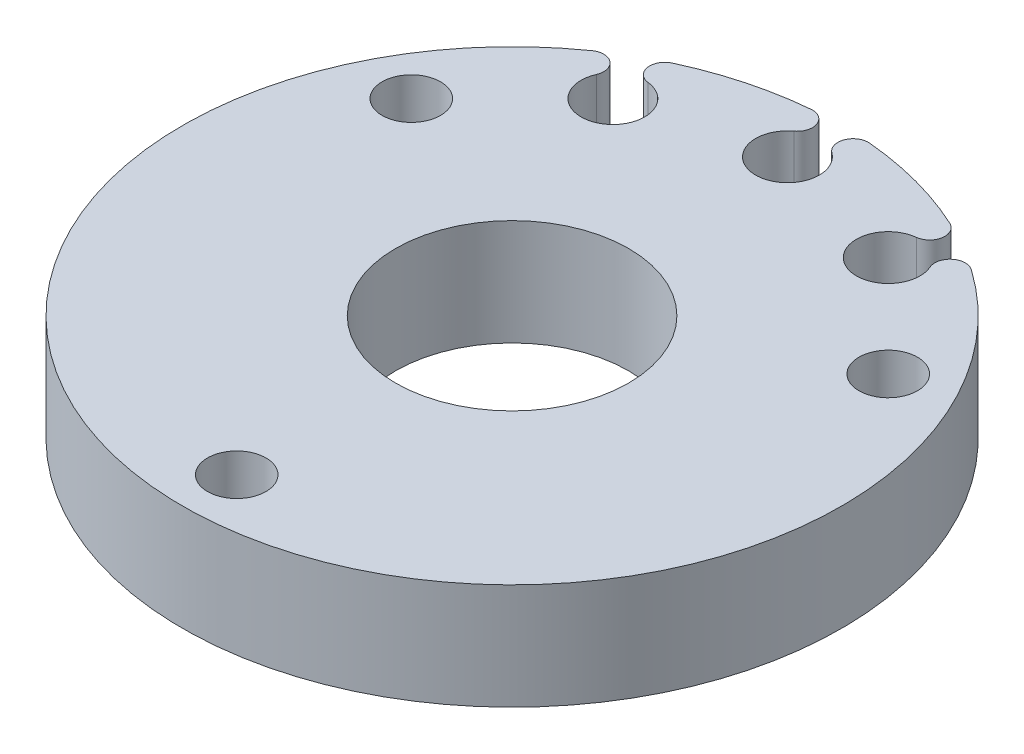
ISO-10303-21;
HEADER;
FILE_DESCRIPTION(('STEP AP214'),'2;1');
FILE_NAME('part.step','',(''),(''),'','','');
FILE_SCHEMA(('AUTOMOTIVE_DESIGN { 1 0 10303 214 1 1 1 1 }'));
ENDSEC;
DATA;
#1=APPLICATION_CONTEXT('core data for automotive mechanical design processes');
#2=APPLICATION_PROTOCOL_DEFINITION('international standard','automotive_design',2000,#1);
#3=PRODUCT_CONTEXT('',#1,'mechanical');
#4=PRODUCT('Part','Part','',(#3));
#5=PRODUCT_RELATED_PRODUCT_CATEGORY('part','',(#4));
#6=PRODUCT_DEFINITION_FORMATION('','',#4);
#7=PRODUCT_DEFINITION_CONTEXT('part definition',#1,'design');
#8=PRODUCT_DEFINITION('design','',#6,#7);
#9=PRODUCT_DEFINITION_SHAPE('','',#8);
#10=(LENGTH_UNIT() NAMED_UNIT(*) SI_UNIT(.MILLI.,.METRE.));
#11=(NAMED_UNIT(*) PLANE_ANGLE_UNIT() SI_UNIT($,.RADIAN.));
#12=(NAMED_UNIT(*) SI_UNIT($,.STERADIAN.) SOLID_ANGLE_UNIT());
#13=UNCERTAINTY_MEASURE_WITH_UNIT(LENGTH_MEASURE(1.E-05),#10,'distance_accuracy_value','');
#14=(GEOMETRIC_REPRESENTATION_CONTEXT(3) GLOBAL_UNCERTAINTY_ASSIGNED_CONTEXT((#13)) GLOBAL_UNIT_ASSIGNED_CONTEXT((#10,
#11,#12)) REPRESENTATION_CONTEXT('',''));
#15=CARTESIAN_POINT('',(0.,0.,0.));
#16=DIRECTION('',(0.,0.,1.));
#17=DIRECTION('',(1.,0.,0.));
#18=AXIS2_PLACEMENT_3D('',#15,#16,#17);
#19=CARTESIAN_POINT('',(0.,6.35,0.));
#20=DIRECTION('',(0.,-1.,0.));
#21=DIRECTION('',(0.,0.,-1.));
#22=AXIS2_PLACEMENT_3D('',#19,#20,#21);
#23=CYLINDRICAL_SURFACE('',#22,19.75);
#24=DIRECTION('',(0.,1.,0.));
#25=VECTOR('',#24,1.);
#26=CARTESIAN_POINT('',(-11.3545625208397,0.,-16.1597156522119));
#27=LINE('',#26,#25);
#28=CARTESIAN_POINT('',(-11.3545625208397,0.,-16.1597156522119));
#29=VERTEX_POINT('',#28);
#30=CARTESIAN_POINT('',(-11.3545625208397,6.35,-16.1597156522119));
#31=VERTEX_POINT('',#30);
#32=EDGE_CURVE('E138',#29,#31,#27,.T.);
#33=ORIENTED_EDGE('',*,*,#32,.F.);
#34=CARTESIAN_POINT('',(0.,0.,0.));
#35=DIRECTION('',(0.,1.,0.));
#36=DIRECTION('',(0.,0.,1.));
#37=AXIS2_PLACEMENT_3D('',#34,#35,#36);
#38=CIRCLE('',#37,19.75);
#39=CARTESIAN_POINT('',(11.3545625208397,0.,-16.1597156522119));
#40=VERTEX_POINT('',#39);
#41=EDGE_CURVE('E151',#29,#40,#38,.T.);
#42=ORIENTED_EDGE('',*,*,#41,.T.);
#43=DIRECTION('',(0.,1.,0.));
#44=VECTOR('',#43,1.);
#45=CARTESIAN_POINT('',(11.3545625208397,0.,-16.1597156522119));
#46=LINE('',#45,#44);
#47=CARTESIAN_POINT('',(11.3545625208397,6.35,-16.1597156522119));
#48=VERTEX_POINT('',#47);
#49=EDGE_CURVE('E186',#40,#48,#46,.T.);
#50=ORIENTED_EDGE('',*,*,#49,.T.);
#51=CARTESIAN_POINT('',(0.,6.35,0.));
#52=DIRECTION('',(0.,1.,0.));
#53=DIRECTION('',(0.,0.,1.));
#54=AXIS2_PLACEMENT_3D('',#51,#52,#53);
#55=CIRCLE('',#54,19.75);
#56=EDGE_CURVE('E47',#31,#48,#55,.T.);
#57=ORIENTED_EDGE('',*,*,#56,.F.);
#58=EDGE_LOOP('',(#33,#42,#50,#57));
#59=FACE_BOUND('',#58,.T.);
#60=ADVANCED_FACE('F37',(#59),#23,.T.);
#61=CARTESIAN_POINT('',(-1.7534817657999,0.,-19.6720055331684));
#62=VERTEX_POINT('',#61);
#63=CARTESIAN_POINT('',(-8.31744301232874,0.,-17.9131974180118));
#64=VERTEX_POINT('',#63);
#65=EDGE_CURVE('E144',#62,#64,#38,.T.);
#66=ORIENTED_EDGE('',*,*,#65,.T.);
#67=DIRECTION('',(0.,1.,0.));
#68=VECTOR('',#67,1.);
#69=CARTESIAN_POINT('',(-8.31744301232874,0.,-17.9131974180118));
#70=LINE('',#69,#68);
#71=CARTESIAN_POINT('',(-8.31744301232874,6.35,-17.9131974180118));
#72=VERTEX_POINT('',#71);
#73=EDGE_CURVE('E128',#64,#72,#70,.T.);
#74=ORIENTED_EDGE('',*,*,#73,.T.);
#75=CARTESIAN_POINT('',(-1.7534817657999,6.35,-19.6720055331684));
#76=VERTEX_POINT('',#75);
#77=EDGE_CURVE('E46',#76,#72,#55,.T.);
#78=ORIENTED_EDGE('',*,*,#77,.F.);
#79=DIRECTION('',(0.,1.,0.));
#80=VECTOR('',#79,1.);
#81=CARTESIAN_POINT('',(-1.7534817657999,0.,-19.6720055331684));
#82=LINE('',#81,#80);
#83=EDGE_CURVE('E150',#62,#76,#82,.T.);
#84=ORIENTED_EDGE('',*,*,#83,.F.);
#85=EDGE_LOOP('',(#66,#74,#78,#84));
#86=FACE_BOUND('',#85,.T.);
#87=ADVANCED_FACE('F149',(#86),#23,.T.);
#88=CARTESIAN_POINT('',(0.,6.35,0.));
#89=DIRECTION('',(0.,1.,0.));
#90=DIRECTION('',(0.,0.,1.));
#91=AXIS2_PLACEMENT_3D('',#88,#89,#90);
#92=PLANE('',#91);
#93=CARTESIAN_POINT('',(-7.93394264831237,6.35,-17.0872563541149));
#94=DIRECTION('',(0.,-1.,0.));
#95=DIRECTION('',(0.86602540378444,0.,0.499999999999998));
#96=AXIS2_PLACEMENT_3D('',#93,#94,#95);
#97=CIRCLE('',#96,0.910632291450185);
#98=CARTESIAN_POINT('',(-8.03616197264353,6.35,-16.1823793569683));
#99=VERTEX_POINT('',#98);
#100=EDGE_CURVE('E133',#99,#72,#97,.T.);
#101=ORIENTED_EDGE('',*,*,#100,.F.);
#102=CARTESIAN_POINT('',(-8.25000000000003,6.35,-14.2894191624432));
#103=DIRECTION('',(0.,1.,0.));
#104=DIRECTION('',(0.86602540378444,0.,0.499999999999998));
#105=AXIS2_PLACEMENT_3D('',#102,#103,#104);
#106=CIRCLE('',#105,1.905);
#107=CARTESIAN_POINT('',(-9.99627063048971,6.35,-15.0507100957198));
#108=VERTEX_POINT('',#107);
#109=EDGE_CURVE('E147',#108,#99,#106,.T.);
#110=ORIENTED_EDGE('',*,*,#109,.F.);
#111=CARTESIAN_POINT('',(-10.8310267594844,6.35,-15.4146240626647));
#112=DIRECTION('',(0.,-1.,0.));
#113=DIRECTION('',(-0.86602540378444,0.,-0.499999999999998));
#114=AXIS2_PLACEMENT_3D('',#111,#112,#113);
#115=CIRCLE('',#114,0.910632291450183);
#116=EDGE_CURVE('E241',#31,#108,#115,.T.);
#117=ORIENTED_EDGE('',*,*,#116,.F.);
#118=ORIENTED_EDGE('',*,*,#56,.T.);
#119=CARTESIAN_POINT('',(10.8310267594844,6.35,-15.4146240626647));
#120=DIRECTION('',(0.,-1.,0.));
#121=DIRECTION('',(0.,0.,1.));
#122=AXIS2_PLACEMENT_3D('',#119,#120,#121);
#123=CIRCLE('',#122,0.910632291450185);
#124=CARTESIAN_POINT('',(9.99627063048967,6.35,-15.0507100957199));
#125=VERTEX_POINT('',#124);
#126=EDGE_CURVE('E201',#125,#48,#123,.T.);
#127=ORIENTED_EDGE('',*,*,#126,.F.);
#128=CARTESIAN_POINT('',(8.25,6.35,-14.2894191624432));
#129=DIRECTION('',(0.,1.,0.));
#130=DIRECTION('',(0.,0.,1.));
#131=AXIS2_PLACEMENT_3D('',#128,#129,#130);
#132=CIRCLE('',#131,1.905);
#133=CARTESIAN_POINT('',(8.03616197264349,6.35,-16.1823793569683));
#134=VERTEX_POINT('',#133);
#135=EDGE_CURVE('E194',#134,#125,#132,.T.);
#136=ORIENTED_EDGE('',*,*,#135,.F.);
#137=CARTESIAN_POINT('',(7.93394264831234,6.35,-17.0872563541149));
#138=DIRECTION('',(0.,-1.,0.));
#139=DIRECTION('',(0.,0.,-1.));
#140=AXIS2_PLACEMENT_3D('',#137,#138,#139);
#141=CIRCLE('',#140,0.910632291450183);
#142=CARTESIAN_POINT('',(8.3174430123287,6.35,-17.9131974180118));
#143=VERTEX_POINT('',#142);
#144=EDGE_CURVE('E198',#143,#134,#141,.T.);
#145=ORIENTED_EDGE('',*,*,#144,.F.);
#146=CARTESIAN_POINT('',(1.75348176579986,6.35,-19.6720055331684));
#147=VERTEX_POINT('',#146);
#148=EDGE_CURVE('E11',#143,#147,#55,.T.);
#149=ORIENTED_EDGE('',*,*,#148,.T.);
#150=CARTESIAN_POINT('',(1.67263229145016,6.35,-18.7649694077967));
#151=DIRECTION('',(0.,-1.,0.));
#152=DIRECTION('',(0.500000000000001,0.,0.866025403784438));
#153=AXIS2_PLACEMENT_3D('',#150,#151,#152);
#154=CIRCLE('',#153,0.910632291450185);
#155=CARTESIAN_POINT('',(1.13166926124839,6.35,-18.0324326031332));
#156=VERTEX_POINT('',#155);
#157=EDGE_CURVE('E227',#156,#147,#154,.T.);
#158=ORIENTED_EDGE('',*,*,#157,.F.);
#159=CARTESIAN_POINT('',(0.,6.35,-16.5));
#160=DIRECTION('',(0.,1.,0.));
#161=DIRECTION('',(0.500000000000001,0.,0.866025403784438));
#162=AXIS2_PLACEMENT_3D('',#159,#160,#161);
#163=CIRCLE('',#162,1.905);
#164=CARTESIAN_POINT('',(-1.13166926124843,6.35,-18.0324326031332));
#165=VERTEX_POINT('',#164);
#166=EDGE_CURVE('E220',#165,#156,#163,.T.);
#167=ORIENTED_EDGE('',*,*,#166,.F.);
#168=CARTESIAN_POINT('',(-1.6726322914502,6.35,-18.7649694077967));
#169=DIRECTION('',(0.,-1.,0.));
#170=DIRECTION('',(-0.500000000000001,0.,-0.866025403784438));
#171=AXIS2_PLACEMENT_3D('',#168,#169,#170);
#172=CIRCLE('',#171,0.910632291450183);
#173=EDGE_CURVE('E224',#76,#165,#172,.T.);
#174=ORIENTED_EDGE('',*,*,#173,.F.);
#175=ORIENTED_EDGE('',*,*,#77,.T.);
#176=EDGE_LOOP('',(#101,#110,#117,#118,#127,#136,#145,#149,#158,#167,#174,#175));
#177=FACE_BOUND('',#176,.T.);
#178=CARTESIAN_POINT('',(0.,6.35,16.5));
#179=DIRECTION('',(0.,1.,0.));
#180=DIRECTION('',(0.,0.,1.));
#181=AXIS2_PLACEMENT_3D('',#178,#179,#180);
#182=CIRCLE('',#181,1.75);
#183=CARTESIAN_POINT('',(0.,6.35,18.25));
#184=VERTEX_POINT('',#183);
#185=EDGE_CURVE('E171',#184,#184,#182,.T.);
#186=ORIENTED_EDGE('',*,*,#185,.F.);
#187=EDGE_LOOP('',(#186));
#188=FACE_BOUND('',#187,.T.);
#189=CARTESIAN_POINT('',(0.,6.35,0.));
#190=DIRECTION('',(0.,1.,0.));
#191=DIRECTION('',(0.,0.,1.));
#192=AXIS2_PLACEMENT_3D('',#189,#190,#191);
#193=CIRCLE('',#192,6.985);
#194=CARTESIAN_POINT('',(0.,6.35,6.985));
#195=VERTEX_POINT('',#194);
#196=EDGE_CURVE('E153',#195,#195,#193,.T.);
#197=ORIENTED_EDGE('',*,*,#196,.F.);
#198=EDGE_LOOP('',(#197));
#199=FACE_BOUND('',#198,.T.);
#200=CARTESIAN_POINT('',(-14.2894191624432,6.35,-8.25));
#201=DIRECTION('',(0.,1.,0.));
#202=DIRECTION('',(0.,0.,1.));
#203=AXIS2_PLACEMENT_3D('',#200,#201,#202);
#204=CIRCLE('',#203,1.75);
#205=CARTESIAN_POINT('',(-14.2894191624432,6.35,-6.5));
#206=VERTEX_POINT('',#205);
#207=EDGE_CURVE('E165',#206,#206,#204,.T.);
#208=ORIENTED_EDGE('',*,*,#207,.F.);
#209=EDGE_LOOP('',(#208));
#210=FACE_BOUND('',#209,.T.);
#211=CARTESIAN_POINT('',(14.2894191624432,6.35,-8.25));
#212=DIRECTION('',(0.,1.,0.));
#213=DIRECTION('',(0.,0.,1.));
#214=AXIS2_PLACEMENT_3D('',#211,#212,#213);
#215=CIRCLE('',#214,1.75);
#216=CARTESIAN_POINT('',(14.2894191624432,6.35,-6.5));
#217=VERTEX_POINT('',#216);
#218=EDGE_CURVE('E177',#217,#217,#215,.T.);
#219=ORIENTED_EDGE('',*,*,#218,.F.);
#220=EDGE_LOOP('',(#219));
#221=FACE_BOUND('',#220,.T.);
#222=ADVANCED_FACE('F253',(#177,#188,#199,#210,#221),#92,.T.);
#223=CARTESIAN_POINT('',(0.,0.,0.));
#224=DIRECTION('',(0.,1.,0.));
#225=DIRECTION('',(0.,0.,1.));
#226=AXIS2_PLACEMENT_3D('',#223,#224,#225);
#227=PLANE('',#226);
#228=CARTESIAN_POINT('',(0.,0.,16.5));
#229=DIRECTION('',(0.,1.,0.));
#230=DIRECTION('',(0.,0.,1.));
#231=AXIS2_PLACEMENT_3D('',#228,#229,#230);
#232=CIRCLE('',#231,1.75);
#233=CARTESIAN_POINT('',(0.,0.,18.25));
#234=VERTEX_POINT('',#233);
#235=EDGE_CURVE('E174',#234,#234,#232,.T.);
#236=ORIENTED_EDGE('',*,*,#235,.T.);
#237=EDGE_LOOP('',(#236));
#238=FACE_BOUND('',#237,.T.);
#239=CARTESIAN_POINT('',(0.,0.,0.));
#240=DIRECTION('',(0.,1.,0.));
#241=DIRECTION('',(0.,0.,1.));
#242=AXIS2_PLACEMENT_3D('',#239,#240,#241);
#243=CIRCLE('',#242,6.985);
#244=CARTESIAN_POINT('',(0.,0.,6.985));
#245=VERTEX_POINT('',#244);
#246=EDGE_CURVE('E160',#245,#245,#243,.T.);
#247=ORIENTED_EDGE('',*,*,#246,.T.);
#248=EDGE_LOOP('',(#247));
#249=FACE_BOUND('',#248,.T.);
#250=CARTESIAN_POINT('',(-8.25000000000003,0.,-14.2894191624432));
#251=DIRECTION('',(0.,1.,0.));
#252=DIRECTION('',(0.86602540378444,0.,0.499999999999998));
#253=AXIS2_PLACEMENT_3D('',#250,#251,#252);
#254=CIRCLE('',#253,1.905);
#255=CARTESIAN_POINT('',(-9.99627063048971,0.,-15.0507100957198));
#256=VERTEX_POINT('',#255);
#257=CARTESIAN_POINT('',(-8.03616197264353,0.,-16.1823793569683));
#258=VERTEX_POINT('',#257);
#259=EDGE_CURVE('E54',#256,#258,#254,.T.);
#260=ORIENTED_EDGE('',*,*,#259,.T.);
#261=CARTESIAN_POINT('',(-7.93394264831237,0.,-17.0872563541149));
#262=DIRECTION('',(0.,-1.,0.));
#263=DIRECTION('',(0.86602540378444,0.,0.499999999999998));
#264=AXIS2_PLACEMENT_3D('',#261,#262,#263);
#265=CIRCLE('',#264,0.910632291450185);
#266=EDGE_CURVE('E131',#258,#64,#265,.T.);
#267=ORIENTED_EDGE('',*,*,#266,.T.);
#268=ORIENTED_EDGE('',*,*,#65,.F.);
#269=CARTESIAN_POINT('',(-1.6726322914502,0.,-18.7649694077967));
#270=DIRECTION('',(0.,-1.,0.));
#271=DIRECTION('',(-0.500000000000001,0.,-0.866025403784438));
#272=AXIS2_PLACEMENT_3D('',#269,#270,#271);
#273=CIRCLE('',#272,0.910632291450183);
#274=CARTESIAN_POINT('',(-1.13166926124843,0.,-18.0324326031332));
#275=VERTEX_POINT('',#274);
#276=EDGE_CURVE('E62',#62,#275,#273,.T.);
#277=ORIENTED_EDGE('',*,*,#276,.T.);
#278=CARTESIAN_POINT('',(0.,0.,-16.5));
#279=DIRECTION('',(0.,1.,0.));
#280=DIRECTION('',(0.500000000000001,0.,0.866025403784438));
#281=AXIS2_PLACEMENT_3D('',#278,#279,#280);
#282=CIRCLE('',#281,1.905);
#283=CARTESIAN_POINT('',(1.13166926124839,0.,-18.0324326031332));
#284=VERTEX_POINT('',#283);
#285=EDGE_CURVE('E215',#275,#284,#282,.T.);
#286=ORIENTED_EDGE('',*,*,#285,.T.);
#287=CARTESIAN_POINT('',(1.67263229145016,0.,-18.7649694077967));
#288=DIRECTION('',(0.,-1.,0.));
#289=DIRECTION('',(0.500000000000001,0.,0.866025403784438));
#290=AXIS2_PLACEMENT_3D('',#287,#288,#289);
#291=CIRCLE('',#290,0.910632291450185);
#292=CARTESIAN_POINT('',(1.75348176579986,0.,-19.6720055331684));
#293=VERTEX_POINT('',#292);
#294=EDGE_CURVE('E223',#284,#293,#291,.T.);
#295=ORIENTED_EDGE('',*,*,#294,.T.);
#296=CARTESIAN_POINT('',(8.3174430123287,0.,-17.9131974180118));
#297=VERTEX_POINT('',#296);
#298=EDGE_CURVE('E41',#297,#293,#38,.T.);
#299=ORIENTED_EDGE('',*,*,#298,.F.);
#300=CARTESIAN_POINT('',(7.93394264831234,0.,-17.0872563541149));
#301=DIRECTION('',(0.,-1.,0.));
#302=DIRECTION('',(0.,0.,-1.));
#303=AXIS2_PLACEMENT_3D('',#300,#301,#302);
#304=CIRCLE('',#303,0.910632291450183);
#305=CARTESIAN_POINT('',(8.03616197264349,0.,-16.1823793569683));
#306=VERTEX_POINT('',#305);
#307=EDGE_CURVE('E207',#297,#306,#304,.T.);
#308=ORIENTED_EDGE('',*,*,#307,.T.);
#309=CARTESIAN_POINT('',(8.25,0.,-14.2894191624432));
#310=DIRECTION('',(0.,1.,0.));
#311=DIRECTION('',(0.,0.,1.));
#312=AXIS2_PLACEMENT_3D('',#309,#310,#311);
#313=CIRCLE('',#312,1.905);
#314=CARTESIAN_POINT('',(9.99627063048967,0.,-15.0507100957199));
#315=VERTEX_POINT('',#314);
#316=EDGE_CURVE('E189',#306,#315,#313,.T.);
#317=ORIENTED_EDGE('',*,*,#316,.T.);
#318=CARTESIAN_POINT('',(10.8310267594844,0.,-15.4146240626647));
#319=DIRECTION('',(0.,-1.,0.));
#320=DIRECTION('',(0.,0.,1.));
#321=AXIS2_PLACEMENT_3D('',#318,#319,#320);
#322=CIRCLE('',#321,0.910632291450185);
#323=EDGE_CURVE('E197',#315,#40,#322,.T.);
#324=ORIENTED_EDGE('',*,*,#323,.T.);
#325=ORIENTED_EDGE('',*,*,#41,.F.);
#326=CARTESIAN_POINT('',(-10.8310267594844,0.,-15.4146240626647));
#327=DIRECTION('',(0.,-1.,0.));
#328=DIRECTION('',(-0.86602540378444,0.,-0.499999999999998));
#329=AXIS2_PLACEMENT_3D('',#326,#327,#328);
#330=CIRCLE('',#329,0.910632291450183);
#331=EDGE_CURVE('E146',#29,#256,#330,.T.);
#332=ORIENTED_EDGE('',*,*,#331,.T.);
#333=EDGE_LOOP('',(#260,#267,#268,#277,#286,#295,#299,#308,#317,#324,#325,#332));
#334=FACE_BOUND('',#333,.T.);
#335=CARTESIAN_POINT('',(-14.2894191624432,0.,-8.25));
#336=DIRECTION('',(0.,1.,0.));
#337=DIRECTION('',(0.,0.,1.));
#338=AXIS2_PLACEMENT_3D('',#335,#336,#337);
#339=CIRCLE('',#338,1.75);
#340=CARTESIAN_POINT('',(-14.2894191624432,0.,-6.5));
#341=VERTEX_POINT('',#340);
#342=EDGE_CURVE('E168',#341,#341,#339,.T.);
#343=ORIENTED_EDGE('',*,*,#342,.T.);
#344=EDGE_LOOP('',(#343));
#345=FACE_BOUND('',#344,.T.);
#346=CARTESIAN_POINT('',(14.2894191624432,0.,-8.25));
#347=DIRECTION('',(0.,1.,0.));
#348=DIRECTION('',(0.,0.,1.));
#349=AXIS2_PLACEMENT_3D('',#346,#347,#348);
#350=CIRCLE('',#349,1.75);
#351=CARTESIAN_POINT('',(14.2894191624432,0.,-6.5));
#352=VERTEX_POINT('',#351);
#353=EDGE_CURVE('E180',#352,#352,#350,.T.);
#354=ORIENTED_EDGE('',*,*,#353,.T.);
#355=EDGE_LOOP('',(#354));
#356=FACE_BOUND('',#355,.T.);
#357=ADVANCED_FACE('F142',(#238,#249,#334,#345,#356),#227,.F.);
#358=ORIENTED_EDGE('',*,*,#298,.T.);
#359=DIRECTION('',(0.,1.,0.));
#360=VECTOR('',#359,1.);
#361=CARTESIAN_POINT('',(1.75348176579986,0.,-19.6720055331684));
#362=LINE('',#361,#360);
#363=EDGE_CURVE('E212',#293,#147,#362,.T.);
#364=ORIENTED_EDGE('',*,*,#363,.T.);
#365=ORIENTED_EDGE('',*,*,#148,.F.);
#366=DIRECTION('',(0.,1.,0.));
#367=VECTOR('',#366,1.);
#368=CARTESIAN_POINT('',(8.3174430123287,0.,-17.9131974180118));
#369=LINE('',#368,#367);
#370=EDGE_CURVE('E188',#297,#143,#369,.T.);
#371=ORIENTED_EDGE('',*,*,#370,.F.);
#372=EDGE_LOOP('',(#358,#364,#365,#371));
#373=FACE_BOUND('',#372,.T.);
#374=ADVANCED_FACE('F39',(#373),#23,.T.);
#375=CARTESIAN_POINT('',(0.,6.35,0.));
#376=DIRECTION('',(0.,-1.,0.));
#377=DIRECTION('',(0.,0.,-1.));
#378=AXIS2_PLACEMENT_3D('',#375,#376,#377);
#379=CYLINDRICAL_SURFACE('',#378,6.985);
#380=ORIENTED_EDGE('',*,*,#196,.T.);
#381=EDGE_LOOP('',(#380));
#382=FACE_BOUND('',#381,.T.);
#383=ORIENTED_EDGE('',*,*,#246,.F.);
#384=EDGE_LOOP('',(#383));
#385=FACE_BOUND('',#384,.T.);
#386=ADVANCED_FACE('F295',(#382,#385),#379,.F.);
#387=CARTESIAN_POINT('',(-14.2894191624432,6.35,-8.25));
#388=DIRECTION('',(0.,-1.,0.));
#389=DIRECTION('',(0.,0.,-1.));
#390=AXIS2_PLACEMENT_3D('',#387,#388,#389);
#391=CYLINDRICAL_SURFACE('',#390,1.75);
#392=ORIENTED_EDGE('',*,*,#207,.T.);
#393=EDGE_LOOP('',(#392));
#394=FACE_BOUND('',#393,.T.);
#395=ORIENTED_EDGE('',*,*,#342,.F.);
#396=EDGE_LOOP('',(#395));
#397=FACE_BOUND('',#396,.T.);
#398=ADVANCED_FACE('F300',(#394,#397),#391,.F.);
#399=CARTESIAN_POINT('',(0.,6.35,16.5));
#400=DIRECTION('',(0.,-1.,0.));
#401=DIRECTION('',(0.,0.,-1.));
#402=AXIS2_PLACEMENT_3D('',#399,#400,#401);
#403=CYLINDRICAL_SURFACE('',#402,1.75);
#404=ORIENTED_EDGE('',*,*,#185,.T.);
#405=EDGE_LOOP('',(#404));
#406=FACE_BOUND('',#405,.T.);
#407=ORIENTED_EDGE('',*,*,#235,.F.);
#408=EDGE_LOOP('',(#407));
#409=FACE_BOUND('',#408,.T.);
#410=ADVANCED_FACE('F286',(#406,#409),#403,.F.);
#411=CARTESIAN_POINT('',(14.2894191624432,6.35,-8.25));
#412=DIRECTION('',(0.,-1.,0.));
#413=DIRECTION('',(0.,0.,-1.));
#414=AXIS2_PLACEMENT_3D('',#411,#412,#413);
#415=CYLINDRICAL_SURFACE('',#414,1.75);
#416=ORIENTED_EDGE('',*,*,#218,.T.);
#417=EDGE_LOOP('',(#416));
#418=FACE_BOUND('',#417,.T.);
#419=ORIENTED_EDGE('',*,*,#353,.F.);
#420=EDGE_LOOP('',(#419));
#421=FACE_BOUND('',#420,.T.);
#422=ADVANCED_FACE('F279',(#418,#421),#415,.F.);
#423=CARTESIAN_POINT('',(10.8310267594844,0.,-15.4146240626647));
#424=DIRECTION('',(0.,1.,0.));
#425=DIRECTION('',(0.,0.,1.));
#426=AXIS2_PLACEMENT_3D('',#423,#424,#425);
#427=CYLINDRICAL_SURFACE('',#426,0.910632291450185);
#428=ORIENTED_EDGE('',*,*,#126,.T.);
#429=ORIENTED_EDGE('',*,*,#49,.F.);
#430=ORIENTED_EDGE('',*,*,#323,.F.);
#431=DIRECTION('',(0.,1.,0.));
#432=VECTOR('',#431,1.);
#433=CARTESIAN_POINT('',(9.99627063048967,0.,-15.0507100957199));
#434=LINE('',#433,#432);
#435=EDGE_CURVE('E183',#315,#125,#434,.T.);
#436=ORIENTED_EDGE('',*,*,#435,.T.);
#437=EDGE_LOOP('',(#428,#429,#430,#436));
#438=FACE_BOUND('',#437,.T.);
#439=ADVANCED_FACE('F277',(#438),#427,.T.);
#440=CARTESIAN_POINT('',(8.25,0.,-14.2894191624432));
#441=DIRECTION('',(0.,1.,0.));
#442=DIRECTION('',(0.,0.,1.));
#443=AXIS2_PLACEMENT_3D('',#440,#441,#442);
#444=CYLINDRICAL_SURFACE('',#443,1.905);
#445=ORIENTED_EDGE('',*,*,#135,.T.);
#446=ORIENTED_EDGE('',*,*,#435,.F.);
#447=ORIENTED_EDGE('',*,*,#316,.F.);
#448=DIRECTION('',(0.,1.,0.));
#449=VECTOR('',#448,1.);
#450=CARTESIAN_POINT('',(8.03616197264349,0.,-16.1823793569683));
#451=LINE('',#450,#449);
#452=EDGE_CURVE('E191',#306,#134,#451,.T.);
#453=ORIENTED_EDGE('',*,*,#452,.T.);
#454=EDGE_LOOP('',(#445,#446,#447,#453));
#455=FACE_BOUND('',#454,.T.);
#456=ADVANCED_FACE('F273',(#455),#444,.F.);
#457=CARTESIAN_POINT('',(7.93394264831234,0.,-17.0872563541149));
#458=DIRECTION('',(0.,1.,0.));
#459=DIRECTION('',(0.,0.,1.));
#460=AXIS2_PLACEMENT_3D('',#457,#458,#459);
#461=CYLINDRICAL_SURFACE('',#460,0.910632291450183);
#462=ORIENTED_EDGE('',*,*,#144,.T.);
#463=ORIENTED_EDGE('',*,*,#452,.F.);
#464=ORIENTED_EDGE('',*,*,#307,.F.);
#465=ORIENTED_EDGE('',*,*,#370,.T.);
#466=EDGE_LOOP('',(#462,#463,#464,#465));
#467=FACE_BOUND('',#466,.T.);
#468=ADVANCED_FACE('F270',(#467),#461,.T.);
#469=CARTESIAN_POINT('',(1.67263229145016,0.,-18.7649694077967));
#470=DIRECTION('',(0.,1.,0.));
#471=DIRECTION('',(0.,0.,1.));
#472=AXIS2_PLACEMENT_3D('',#469,#470,#471);
#473=CYLINDRICAL_SURFACE('',#472,0.910632291450185);
#474=ORIENTED_EDGE('',*,*,#157,.T.);
#475=ORIENTED_EDGE('',*,*,#363,.F.);
#476=ORIENTED_EDGE('',*,*,#294,.F.);
#477=DIRECTION('',(0.,1.,0.));
#478=VECTOR('',#477,1.);
#479=CARTESIAN_POINT('',(1.13166926124839,0.,-18.0324326031332));
#480=LINE('',#479,#478);
#481=EDGE_CURVE('E204',#284,#156,#480,.T.);
#482=ORIENTED_EDGE('',*,*,#481,.T.);
#483=EDGE_LOOP('',(#474,#475,#476,#482));
#484=FACE_BOUND('',#483,.T.);
#485=ADVANCED_FACE('F353',(#484),#473,.T.);
#486=CARTESIAN_POINT('',(0.,0.,-16.5));
#487=DIRECTION('',(0.,1.,0.));
#488=DIRECTION('',(0.,0.,1.));
#489=AXIS2_PLACEMENT_3D('',#486,#487,#488);
#490=CYLINDRICAL_SURFACE('',#489,1.905);
#491=ORIENTED_EDGE('',*,*,#166,.T.);
#492=ORIENTED_EDGE('',*,*,#481,.F.);
#493=ORIENTED_EDGE('',*,*,#285,.F.);
#494=DIRECTION('',(0.,1.,0.));
#495=VECTOR('',#494,1.);
#496=CARTESIAN_POINT('',(-1.13166926124843,0.,-18.0324326031332));
#497=LINE('',#496,#495);
#498=EDGE_CURVE('E217',#275,#165,#497,.T.);
#499=ORIENTED_EDGE('',*,*,#498,.T.);
#500=EDGE_LOOP('',(#491,#492,#493,#499));
#501=FACE_BOUND('',#500,.T.);
#502=ADVANCED_FACE('F261',(#501),#490,.F.);
#503=CARTESIAN_POINT('',(-1.6726322914502,0.,-18.7649694077967));
#504=DIRECTION('',(0.,1.,0.));
#505=DIRECTION('',(0.,0.,1.));
#506=AXIS2_PLACEMENT_3D('',#503,#504,#505);
#507=CYLINDRICAL_SURFACE('',#506,0.910632291450183);
#508=ORIENTED_EDGE('',*,*,#173,.T.);
#509=ORIENTED_EDGE('',*,*,#498,.F.);
#510=ORIENTED_EDGE('',*,*,#276,.F.);
#511=ORIENTED_EDGE('',*,*,#83,.T.);
#512=EDGE_LOOP('',(#508,#509,#510,#511));
#513=FACE_BOUND('',#512,.T.);
#514=ADVANCED_FACE('F258',(#513),#507,.T.);
#515=CARTESIAN_POINT('',(-7.93394264831237,0.,-17.0872563541149));
#516=DIRECTION('',(0.,1.,0.));
#517=DIRECTION('',(0.,0.,1.));
#518=AXIS2_PLACEMENT_3D('',#515,#516,#517);
#519=CYLINDRICAL_SURFACE('',#518,0.910632291450185);
#520=ORIENTED_EDGE('',*,*,#100,.T.);
#521=ORIENTED_EDGE('',*,*,#73,.F.);
#522=ORIENTED_EDGE('',*,*,#266,.F.);
#523=DIRECTION('',(0.,1.,0.));
#524=VECTOR('',#523,1.);
#525=CARTESIAN_POINT('',(-8.03616197264353,0.,-16.1823793569683));
#526=LINE('',#525,#524);
#527=EDGE_CURVE('E229',#258,#99,#526,.T.);
#528=ORIENTED_EDGE('',*,*,#527,.T.);
#529=EDGE_LOOP('',(#520,#521,#522,#528));
#530=FACE_BOUND('',#529,.T.);
#531=ADVANCED_FACE('F130',(#530),#519,.T.);
#532=CARTESIAN_POINT('',(-8.25000000000003,0.,-14.2894191624432));
#533=DIRECTION('',(0.,1.,0.));
#534=DIRECTION('',(0.,0.,1.));
#535=AXIS2_PLACEMENT_3D('',#532,#533,#534);
#536=CYLINDRICAL_SURFACE('',#535,1.905);
#537=ORIENTED_EDGE('',*,*,#109,.T.);
#538=ORIENTED_EDGE('',*,*,#527,.F.);
#539=ORIENTED_EDGE('',*,*,#259,.F.);
#540=DIRECTION('',(0.,1.,0.));
#541=VECTOR('',#540,1.);
#542=CARTESIAN_POINT('',(-9.99627063048971,0.,-15.0507100957198));
#543=LINE('',#542,#541);
#544=EDGE_CURVE('E236',#256,#108,#543,.T.);
#545=ORIENTED_EDGE('',*,*,#544,.T.);
#546=EDGE_LOOP('',(#537,#538,#539,#545));
#547=FACE_BOUND('',#546,.T.);
#548=ADVANCED_FACE('F411',(#547),#536,.F.);
#549=CARTESIAN_POINT('',(-10.8310267594844,0.,-15.4146240626647));
#550=DIRECTION('',(0.,1.,0.));
#551=DIRECTION('',(0.,0.,1.));
#552=AXIS2_PLACEMENT_3D('',#549,#550,#551);
#553=CYLINDRICAL_SURFACE('',#552,0.910632291450183);
#554=ORIENTED_EDGE('',*,*,#116,.T.);
#555=ORIENTED_EDGE('',*,*,#544,.F.);
#556=ORIENTED_EDGE('',*,*,#331,.F.);
#557=ORIENTED_EDGE('',*,*,#32,.T.);
#558=EDGE_LOOP('',(#554,#555,#556,#557));
#559=FACE_BOUND('',#558,.T.);
#560=ADVANCED_FACE('F247',(#559),#553,.T.);
#561=CLOSED_SHELL('',(#60,#87,#222,#357,#374,#386,#398,#410,#422,#439,#456,#468,#485,#502,#514,
#531,#548,#560));
#562=MANIFOLD_SOLID_BREP('B2',#561);
#563=ADVANCED_BREP_SHAPE_REPRESENTATION('',(#18,#562),#14);
#564=SHAPE_DEFINITION_REPRESENTATION(#9,#563);
ENDSEC;
END-ISO-10303-21;
